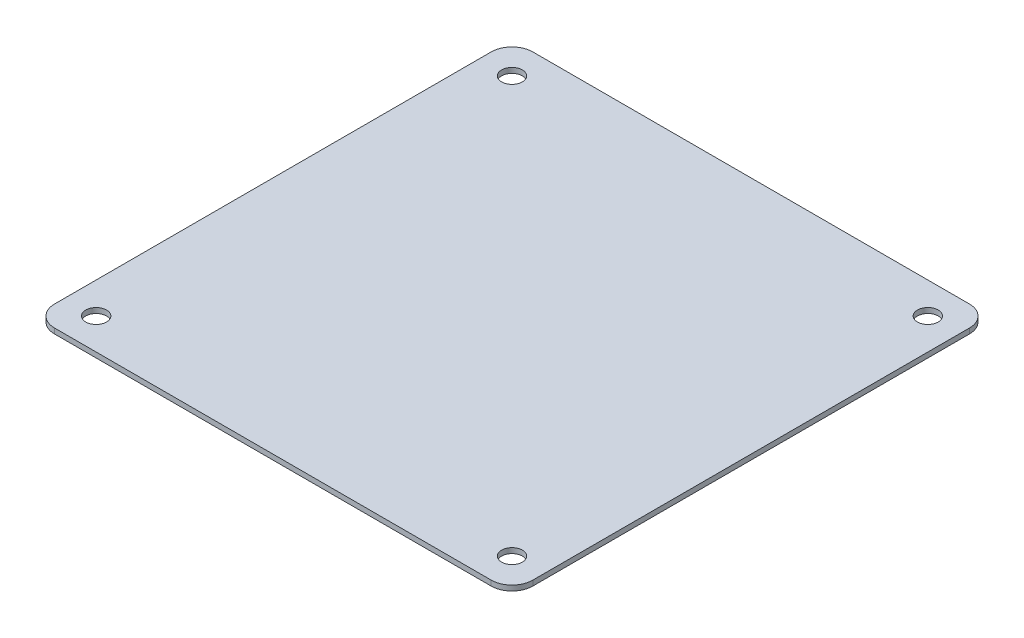
ISO-10303-21;
HEADER;
FILE_DESCRIPTION(('STEP AP214'),'2;1');
FILE_NAME('part.step','',(''),(''),'','','');
FILE_SCHEMA(('AUTOMOTIVE_DESIGN { 1 0 10303 214 1 1 1 1 }'));
ENDSEC;
DATA;
#1=APPLICATION_CONTEXT('core data for automotive mechanical design processes');
#2=APPLICATION_PROTOCOL_DEFINITION('international standard','automotive_design',2000,#1);
#3=PRODUCT_CONTEXT('',#1,'mechanical');
#4=PRODUCT('Part','Part','',(#3));
#5=PRODUCT_RELATED_PRODUCT_CATEGORY('part','',(#4));
#6=PRODUCT_DEFINITION_FORMATION('','',#4);
#7=PRODUCT_DEFINITION_CONTEXT('part definition',#1,'design');
#8=PRODUCT_DEFINITION('design','',#6,#7);
#9=PRODUCT_DEFINITION_SHAPE('','',#8);
#10=(LENGTH_UNIT() NAMED_UNIT(*) SI_UNIT(.MILLI.,.METRE.));
#11=(NAMED_UNIT(*) PLANE_ANGLE_UNIT() SI_UNIT($,.RADIAN.));
#12=(NAMED_UNIT(*) SI_UNIT($,.STERADIAN.) SOLID_ANGLE_UNIT());
#13=UNCERTAINTY_MEASURE_WITH_UNIT(LENGTH_MEASURE(1.E-05),#10,'distance_accuracy_value','');
#14=(GEOMETRIC_REPRESENTATION_CONTEXT(3) GLOBAL_UNCERTAINTY_ASSIGNED_CONTEXT((#13)) GLOBAL_UNIT_ASSIGNED_CONTEXT((#10,
#11,#12)) REPRESENTATION_CONTEXT('',''));
#15=CARTESIAN_POINT('',(0.,0.,0.));
#16=DIRECTION('',(0.,0.,1.));
#17=DIRECTION('',(1.,0.,0.));
#18=AXIS2_PLACEMENT_3D('',#15,#16,#17);
#19=CARTESIAN_POINT('',(21.,0.5,-21.));
#20=DIRECTION('',(0.,1.,0.));
#21=DIRECTION('',(0.,0.,1.));
#22=AXIS2_PLACEMENT_3D('',#19,#20,#21);
#23=PLANE('',#22);
#24=CARTESIAN_POINT('',(-20.,0.5,20.));
#25=DIRECTION('',(0.,1.,0.));
#26=DIRECTION('',(0.,0.,1.));
#27=AXIS2_PLACEMENT_3D('',#24,#25,#26);
#28=CIRCLE('',#27,1.);
#29=CARTESIAN_POINT('',(-20.,0.5,21.));
#30=VERTEX_POINT('',#29);
#31=EDGE_CURVE('E190',#30,#30,#28,.T.);
#32=ORIENTED_EDGE('',*,*,#31,.F.);
#33=EDGE_LOOP('',(#32));
#34=FACE_BOUND('',#33,.T.);
#35=CARTESIAN_POINT('',(-20.,0.5,-20.));
#36=DIRECTION('',(0.,1.,0.));
#37=DIRECTION('',(0.,0.,1.));
#38=AXIS2_PLACEMENT_3D('',#35,#36,#37);
#39=CIRCLE('',#38,1.);
#40=CARTESIAN_POINT('',(-20.,0.5,-19.));
#41=VERTEX_POINT('',#40);
#42=EDGE_CURVE('E136',#41,#41,#39,.T.);
#43=ORIENTED_EDGE('',*,*,#42,.F.);
#44=EDGE_LOOP('',(#43));
#45=FACE_BOUND('',#44,.T.);
#46=CARTESIAN_POINT('',(21.,0.5,-21.));
#47=DIRECTION('',(0.,1.,0.));
#48=DIRECTION('',(0.,0.,1.));
#49=AXIS2_PLACEMENT_3D('',#46,#47,#48);
#50=CIRCLE('',#49,2.);
#51=CARTESIAN_POINT('',(23.,0.5,-21.));
#52=VERTEX_POINT('',#51);
#53=CARTESIAN_POINT('',(21.,0.5,-23.));
#54=VERTEX_POINT('',#53);
#55=EDGE_CURVE('E147',#52,#54,#50,.T.);
#56=ORIENTED_EDGE('',*,*,#55,.T.);
#57=DIRECTION('',(-1.,0.,0.));
#58=VECTOR('',#57,1.);
#59=CARTESIAN_POINT('',(-21.,0.5,-23.));
#60=LINE('',#59,#58);
#61=CARTESIAN_POINT('',(-21.,0.5,-23.));
#62=VERTEX_POINT('',#61);
#63=EDGE_CURVE('E95',#54,#62,#60,.T.);
#64=ORIENTED_EDGE('',*,*,#63,.T.);
#65=CARTESIAN_POINT('',(-21.,0.5,-21.));
#66=DIRECTION('',(0.,1.,0.));
#67=DIRECTION('',(0.,0.,-1.));
#68=AXIS2_PLACEMENT_3D('',#65,#66,#67);
#69=CIRCLE('',#68,2.);
#70=CARTESIAN_POINT('',(-23.,0.5,-21.));
#71=VERTEX_POINT('',#70);
#72=EDGE_CURVE('E162',#62,#71,#69,.T.);
#73=ORIENTED_EDGE('',*,*,#72,.T.);
#74=DIRECTION('',(0.,0.,1.));
#75=VECTOR('',#74,1.);
#76=CARTESIAN_POINT('',(-23.,0.5,-21.));
#77=LINE('',#76,#75);
#78=CARTESIAN_POINT('',(-23.,0.5,21.));
#79=VERTEX_POINT('',#78);
#80=EDGE_CURVE('E175',#71,#79,#77,.T.);
#81=ORIENTED_EDGE('',*,*,#80,.T.);
#82=CARTESIAN_POINT('',(-21.,0.5,21.));
#83=DIRECTION('',(0.,1.,0.));
#84=DIRECTION('',(0.,0.,-1.));
#85=AXIS2_PLACEMENT_3D('',#82,#83,#84);
#86=CIRCLE('',#85,2.);
#87=CARTESIAN_POINT('',(-21.,0.5,23.));
#88=VERTEX_POINT('',#87);
#89=EDGE_CURVE('E114',#79,#88,#86,.T.);
#90=ORIENTED_EDGE('',*,*,#89,.T.);
#91=DIRECTION('',(1.,0.,0.));
#92=VECTOR('',#91,1.);
#93=CARTESIAN_POINT('',(-21.,0.5,23.));
#94=LINE('',#93,#92);
#95=CARTESIAN_POINT('',(21.,0.5,23.));
#96=VERTEX_POINT('',#95);
#97=EDGE_CURVE('E108',#88,#96,#94,.T.);
#98=ORIENTED_EDGE('',*,*,#97,.T.);
#99=CARTESIAN_POINT('',(21.,0.5,21.));
#100=DIRECTION('',(0.,1.,0.));
#101=DIRECTION('',(0.,0.,-1.));
#102=AXIS2_PLACEMENT_3D('',#99,#100,#101);
#103=CIRCLE('',#102,2.);
#104=CARTESIAN_POINT('',(23.,0.5,21.));
#105=VERTEX_POINT('',#104);
#106=EDGE_CURVE('E112',#96,#105,#103,.T.);
#107=ORIENTED_EDGE('',*,*,#106,.T.);
#108=DIRECTION('',(0.,0.,-1.));
#109=VECTOR('',#108,1.);
#110=CARTESIAN_POINT('',(23.,0.5,-21.));
#111=LINE('',#110,#109);
#112=EDGE_CURVE('E52',#105,#52,#111,.T.);
#113=ORIENTED_EDGE('',*,*,#112,.T.);
#114=EDGE_LOOP('',(#56,#64,#73,#81,#90,#98,#107,#113));
#115=FACE_BOUND('',#114,.T.);
#116=CARTESIAN_POINT('',(20.,0.5,-20.));
#117=DIRECTION('',(0.,1.,0.));
#118=DIRECTION('',(0.,0.,1.));
#119=AXIS2_PLACEMENT_3D('',#116,#117,#118);
#120=CIRCLE('',#119,1.);
#121=CARTESIAN_POINT('',(20.,0.5,-19.));
#122=VERTEX_POINT('',#121);
#123=EDGE_CURVE('E184',#122,#122,#120,.T.);
#124=ORIENTED_EDGE('',*,*,#123,.F.);
#125=EDGE_LOOP('',(#124));
#126=FACE_BOUND('',#125,.T.);
#127=CARTESIAN_POINT('',(20.,0.5,20.));
#128=DIRECTION('',(0.,1.,0.));
#129=DIRECTION('',(0.,0.,1.));
#130=AXIS2_PLACEMENT_3D('',#127,#128,#129);
#131=CIRCLE('',#130,0.999999999999998);
#132=CARTESIAN_POINT('',(20.,0.5,21.));
#133=VERTEX_POINT('',#132);
#134=EDGE_CURVE('E196',#133,#133,#131,.T.);
#135=ORIENTED_EDGE('',*,*,#134,.F.);
#136=EDGE_LOOP('',(#135));
#137=FACE_BOUND('',#136,.T.);
#138=ADVANCED_FACE('F35',(#34,#45,#115,#126,#137),#23,.T.);
#139=CARTESIAN_POINT('',(21.,0.,-21.));
#140=DIRECTION('',(0.,1.,0.));
#141=DIRECTION('',(0.,0.,1.));
#142=AXIS2_PLACEMENT_3D('',#139,#140,#141);
#143=PLANE('',#142);
#144=CARTESIAN_POINT('',(21.,0.,-21.));
#145=DIRECTION('',(0.,1.,0.));
#146=DIRECTION('',(0.,0.,1.));
#147=AXIS2_PLACEMENT_3D('',#144,#145,#146);
#148=CIRCLE('',#147,2.);
#149=CARTESIAN_POINT('',(23.,0.,-21.));
#150=VERTEX_POINT('',#149);
#151=CARTESIAN_POINT('',(21.,0.,-23.));
#152=VERTEX_POINT('',#151);
#153=EDGE_CURVE('E132',#150,#152,#148,.T.);
#154=ORIENTED_EDGE('',*,*,#153,.F.);
#155=DIRECTION('',(0.,0.,-1.));
#156=VECTOR('',#155,1.);
#157=CARTESIAN_POINT('',(23.,0.,-21.));
#158=LINE('',#157,#156);
#159=CARTESIAN_POINT('',(23.,0.,21.));
#160=VERTEX_POINT('',#159);
#161=EDGE_CURVE('E87',#160,#150,#158,.T.);
#162=ORIENTED_EDGE('',*,*,#161,.F.);
#163=CARTESIAN_POINT('',(21.,0.,21.));
#164=DIRECTION('',(0.,1.,0.));
#165=DIRECTION('',(0.,0.,-1.));
#166=AXIS2_PLACEMENT_3D('',#163,#164,#165);
#167=CIRCLE('',#166,2.);
#168=CARTESIAN_POINT('',(21.,0.,23.));
#169=VERTEX_POINT('',#168);
#170=EDGE_CURVE('E81',#169,#160,#167,.T.);
#171=ORIENTED_EDGE('',*,*,#170,.F.);
#172=DIRECTION('',(1.,0.,0.));
#173=VECTOR('',#172,1.);
#174=CARTESIAN_POINT('',(-21.,0.,23.));
#175=LINE('',#174,#173);
#176=CARTESIAN_POINT('',(-21.,0.,23.));
#177=VERTEX_POINT('',#176);
#178=EDGE_CURVE('E122',#177,#169,#175,.T.);
#179=ORIENTED_EDGE('',*,*,#178,.F.);
#180=CARTESIAN_POINT('',(-21.,0.,21.));
#181=DIRECTION('',(0.,1.,0.));
#182=DIRECTION('',(0.,0.,-1.));
#183=AXIS2_PLACEMENT_3D('',#180,#181,#182);
#184=CIRCLE('',#183,2.);
#185=CARTESIAN_POINT('',(-23.,0.,21.));
#186=VERTEX_POINT('',#185);
#187=EDGE_CURVE('E142',#186,#177,#184,.T.);
#188=ORIENTED_EDGE('',*,*,#187,.F.);
#189=DIRECTION('',(0.,0.,1.));
#190=VECTOR('',#189,1.);
#191=CARTESIAN_POINT('',(-23.,0.,-21.));
#192=LINE('',#191,#190);
#193=CARTESIAN_POINT('',(-23.,0.,-21.));
#194=VERTEX_POINT('',#193);
#195=EDGE_CURVE('E140',#194,#186,#192,.T.);
#196=ORIENTED_EDGE('',*,*,#195,.F.);
#197=CARTESIAN_POINT('',(-21.,0.,-21.));
#198=DIRECTION('',(0.,1.,0.));
#199=DIRECTION('',(0.,0.,-1.));
#200=AXIS2_PLACEMENT_3D('',#197,#198,#199);
#201=CIRCLE('',#200,2.);
#202=CARTESIAN_POINT('',(-21.,0.,-23.));
#203=VERTEX_POINT('',#202);
#204=EDGE_CURVE('E138',#203,#194,#201,.T.);
#205=ORIENTED_EDGE('',*,*,#204,.F.);
#206=DIRECTION('',(-1.,0.,0.));
#207=VECTOR('',#206,1.);
#208=CARTESIAN_POINT('',(-21.,0.,-23.));
#209=LINE('',#208,#207);
#210=EDGE_CURVE('E135',#152,#203,#209,.T.);
#211=ORIENTED_EDGE('',*,*,#210,.F.);
#212=EDGE_LOOP('',(#154,#162,#171,#179,#188,#196,#205,#211));
#213=FACE_BOUND('',#212,.T.);
#214=CARTESIAN_POINT('',(-20.,0.,-20.));
#215=DIRECTION('',(0.,1.,0.));
#216=DIRECTION('',(0.,0.,1.));
#217=AXIS2_PLACEMENT_3D('',#214,#215,#216);
#218=CIRCLE('',#217,1.);
#219=CARTESIAN_POINT('',(-20.,0.,-19.));
#220=VERTEX_POINT('',#219);
#221=EDGE_CURVE('E181',#220,#220,#218,.T.);
#222=ORIENTED_EDGE('',*,*,#221,.T.);
#223=EDGE_LOOP('',(#222));
#224=FACE_BOUND('',#223,.T.);
#225=CARTESIAN_POINT('',(20.,0.,-20.));
#226=DIRECTION('',(0.,1.,0.));
#227=DIRECTION('',(0.,0.,1.));
#228=AXIS2_PLACEMENT_3D('',#225,#226,#227);
#229=CIRCLE('',#228,1.);
#230=CARTESIAN_POINT('',(20.,0.,-19.));
#231=VERTEX_POINT('',#230);
#232=EDGE_CURVE('E187',#231,#231,#229,.T.);
#233=ORIENTED_EDGE('',*,*,#232,.T.);
#234=EDGE_LOOP('',(#233));
#235=FACE_BOUND('',#234,.T.);
#236=CARTESIAN_POINT('',(-20.,0.,20.));
#237=DIRECTION('',(0.,1.,0.));
#238=DIRECTION('',(0.,0.,1.));
#239=AXIS2_PLACEMENT_3D('',#236,#237,#238);
#240=CIRCLE('',#239,1.);
#241=CARTESIAN_POINT('',(-20.,0.,21.));
#242=VERTEX_POINT('',#241);
#243=EDGE_CURVE('E193',#242,#242,#240,.T.);
#244=ORIENTED_EDGE('',*,*,#243,.T.);
#245=EDGE_LOOP('',(#244));
#246=FACE_BOUND('',#245,.T.);
#247=CARTESIAN_POINT('',(20.,0.,20.));
#248=DIRECTION('',(0.,1.,0.));
#249=DIRECTION('',(0.,0.,1.));
#250=AXIS2_PLACEMENT_3D('',#247,#248,#249);
#251=CIRCLE('',#250,0.999999999999998);
#252=CARTESIAN_POINT('',(20.,0.,21.));
#253=VERTEX_POINT('',#252);
#254=EDGE_CURVE('E199',#253,#253,#251,.T.);
#255=ORIENTED_EDGE('',*,*,#254,.T.);
#256=EDGE_LOOP('',(#255));
#257=FACE_BOUND('',#256,.T.);
#258=ADVANCED_FACE('F166',(#213,#224,#235,#246,#257),#143,.F.);
#259=CARTESIAN_POINT('',(21.,0.5,-21.));
#260=DIRECTION('',(0.,-1.,0.));
#261=DIRECTION('',(0.,0.,-1.));
#262=AXIS2_PLACEMENT_3D('',#259,#260,#261);
#263=CYLINDRICAL_SURFACE('',#262,2.);
#264=ORIENTED_EDGE('',*,*,#153,.T.);
#265=DIRECTION('',(0.,-1.,0.));
#266=VECTOR('',#265,1.);
#267=CARTESIAN_POINT('',(21.,0.5,-23.));
#268=LINE('',#267,#266);
#269=EDGE_CURVE('E11',#54,#152,#268,.T.);
#270=ORIENTED_EDGE('',*,*,#269,.F.);
#271=ORIENTED_EDGE('',*,*,#55,.F.);
#272=DIRECTION('',(0.,-1.,0.));
#273=VECTOR('',#272,1.);
#274=CARTESIAN_POINT('',(23.,0.5,-21.));
#275=LINE('',#274,#273);
#276=EDGE_CURVE('E128',#52,#150,#275,.T.);
#277=ORIENTED_EDGE('',*,*,#276,.T.);
#278=EDGE_LOOP('',(#264,#270,#271,#277));
#279=FACE_BOUND('',#278,.T.);
#280=ADVANCED_FACE('F37',(#279),#263,.T.);
#281=CARTESIAN_POINT('',(-21.,0.5,-23.));
#282=DIRECTION('',(0.,0.,1.));
#283=DIRECTION('',(1.,0.,0.));
#284=AXIS2_PLACEMENT_3D('',#281,#282,#283);
#285=PLANE('',#284);
#286=ORIENTED_EDGE('',*,*,#210,.T.);
#287=DIRECTION('',(0.,-1.,0.));
#288=VECTOR('',#287,1.);
#289=CARTESIAN_POINT('',(-21.,0.5,-23.));
#290=LINE('',#289,#288);
#291=EDGE_CURVE('E44',#62,#203,#290,.T.);
#292=ORIENTED_EDGE('',*,*,#291,.F.);
#293=ORIENTED_EDGE('',*,*,#63,.F.);
#294=ORIENTED_EDGE('',*,*,#269,.T.);
#295=EDGE_LOOP('',(#286,#292,#293,#294));
#296=FACE_BOUND('',#295,.T.);
#297=ADVANCED_FACE('F233',(#296),#285,.F.);
#298=CARTESIAN_POINT('',(-21.,0.5,-21.));
#299=DIRECTION('',(0.,-1.,0.));
#300=DIRECTION('',(0.,0.,-1.));
#301=AXIS2_PLACEMENT_3D('',#298,#299,#300);
#302=CYLINDRICAL_SURFACE('',#301,2.);
#303=ORIENTED_EDGE('',*,*,#204,.T.);
#304=DIRECTION('',(0.,-1.,0.));
#305=VECTOR('',#304,1.);
#306=CARTESIAN_POINT('',(-23.,0.5,-21.));
#307=LINE('',#306,#305);
#308=EDGE_CURVE('E154',#71,#194,#307,.T.);
#309=ORIENTED_EDGE('',*,*,#308,.F.);
#310=ORIENTED_EDGE('',*,*,#72,.F.);
#311=ORIENTED_EDGE('',*,*,#291,.T.);
#312=EDGE_LOOP('',(#303,#309,#310,#311));
#313=FACE_BOUND('',#312,.T.);
#314=ADVANCED_FACE('F160',(#313),#302,.T.);
#315=CARTESIAN_POINT('',(-23.,0.5,-21.));
#316=DIRECTION('',(1.,0.,0.));
#317=DIRECTION('',(0.,0.,-1.));
#318=AXIS2_PLACEMENT_3D('',#315,#316,#317);
#319=PLANE('',#318);
#320=ORIENTED_EDGE('',*,*,#195,.T.);
#321=DIRECTION('',(0.,-1.,0.));
#322=VECTOR('',#321,1.);
#323=CARTESIAN_POINT('',(-23.,0.5,21.));
#324=LINE('',#323,#322);
#325=EDGE_CURVE('E151',#79,#186,#324,.T.);
#326=ORIENTED_EDGE('',*,*,#325,.F.);
#327=ORIENTED_EDGE('',*,*,#80,.F.);
#328=ORIENTED_EDGE('',*,*,#308,.T.);
#329=EDGE_LOOP('',(#320,#326,#327,#328));
#330=FACE_BOUND('',#329,.T.);
#331=ADVANCED_FACE('F171',(#330),#319,.F.);
#332=CARTESIAN_POINT('',(-21.,0.5,21.));
#333=DIRECTION('',(0.,-1.,0.));
#334=DIRECTION('',(0.,0.,-1.));
#335=AXIS2_PLACEMENT_3D('',#332,#333,#334);
#336=CYLINDRICAL_SURFACE('',#335,2.);
#337=ORIENTED_EDGE('',*,*,#187,.T.);
#338=DIRECTION('',(0.,-1.,0.));
#339=VECTOR('',#338,1.);
#340=CARTESIAN_POINT('',(-21.,0.5,23.));
#341=LINE('',#340,#339);
#342=EDGE_CURVE('E123',#88,#177,#341,.T.);
#343=ORIENTED_EDGE('',*,*,#342,.F.);
#344=ORIENTED_EDGE('',*,*,#89,.F.);
#345=ORIENTED_EDGE('',*,*,#325,.T.);
#346=EDGE_LOOP('',(#337,#343,#344,#345));
#347=FACE_BOUND('',#346,.T.);
#348=ADVANCED_FACE('F174',(#347),#336,.T.);
#349=CARTESIAN_POINT('',(-21.,0.5,23.));
#350=DIRECTION('',(0.,0.,-1.));
#351=DIRECTION('',(-1.,0.,0.));
#352=AXIS2_PLACEMENT_3D('',#349,#350,#351);
#353=PLANE('',#352);
#354=ORIENTED_EDGE('',*,*,#178,.T.);
#355=DIRECTION('',(0.,-1.,0.));
#356=VECTOR('',#355,1.);
#357=CARTESIAN_POINT('',(21.,0.5,23.));
#358=LINE('',#357,#356);
#359=EDGE_CURVE('E119',#96,#169,#358,.T.);
#360=ORIENTED_EDGE('',*,*,#359,.F.);
#361=ORIENTED_EDGE('',*,*,#97,.F.);
#362=ORIENTED_EDGE('',*,*,#342,.T.);
#363=EDGE_LOOP('',(#354,#360,#361,#362));
#364=FACE_BOUND('',#363,.T.);
#365=ADVANCED_FACE('F120',(#364),#353,.F.);
#366=CARTESIAN_POINT('',(21.,0.5,21.));
#367=DIRECTION('',(0.,-1.,0.));
#368=DIRECTION('',(0.,0.,-1.));
#369=AXIS2_PLACEMENT_3D('',#366,#367,#368);
#370=CYLINDRICAL_SURFACE('',#369,2.);
#371=ORIENTED_EDGE('',*,*,#170,.T.);
#372=DIRECTION('',(0.,-1.,0.));
#373=VECTOR('',#372,1.);
#374=CARTESIAN_POINT('',(23.,0.5,21.));
#375=LINE('',#374,#373);
#376=EDGE_CURVE('E124',#105,#160,#375,.T.);
#377=ORIENTED_EDGE('',*,*,#376,.F.);
#378=ORIENTED_EDGE('',*,*,#106,.F.);
#379=ORIENTED_EDGE('',*,*,#359,.T.);
#380=EDGE_LOOP('',(#371,#377,#378,#379));
#381=FACE_BOUND('',#380,.T.);
#382=ADVANCED_FACE('F126',(#381),#370,.T.);
#383=CARTESIAN_POINT('',(23.,0.5,-21.));
#384=DIRECTION('',(-1.,0.,0.));
#385=DIRECTION('',(0.,0.,1.));
#386=AXIS2_PLACEMENT_3D('',#383,#384,#385);
#387=PLANE('',#386);
#388=ORIENTED_EDGE('',*,*,#161,.T.);
#389=ORIENTED_EDGE('',*,*,#276,.F.);
#390=ORIENTED_EDGE('',*,*,#112,.F.);
#391=ORIENTED_EDGE('',*,*,#376,.T.);
#392=EDGE_LOOP('',(#388,#389,#390,#391));
#393=FACE_BOUND('',#392,.T.);
#394=ADVANCED_FACE('F221',(#393),#387,.F.);
#395=CARTESIAN_POINT('',(-20.,0.5,-20.));
#396=DIRECTION('',(0.,-1.,0.));
#397=DIRECTION('',(0.,0.,-1.));
#398=AXIS2_PLACEMENT_3D('',#395,#396,#397);
#399=CYLINDRICAL_SURFACE('',#398,1.);
#400=ORIENTED_EDGE('',*,*,#42,.T.);
#401=EDGE_LOOP('',(#400));
#402=FACE_BOUND('',#401,.T.);
#403=ORIENTED_EDGE('',*,*,#221,.F.);
#404=EDGE_LOOP('',(#403));
#405=FACE_BOUND('',#404,.T.);
#406=ADVANCED_FACE('F218',(#402,#405),#399,.F.);
#407=CARTESIAN_POINT('',(20.,0.5,-20.));
#408=DIRECTION('',(0.,-1.,0.));
#409=DIRECTION('',(0.,0.,-1.));
#410=AXIS2_PLACEMENT_3D('',#407,#408,#409);
#411=CYLINDRICAL_SURFACE('',#410,1.);
#412=ORIENTED_EDGE('',*,*,#123,.T.);
#413=EDGE_LOOP('',(#412));
#414=FACE_BOUND('',#413,.T.);
#415=ORIENTED_EDGE('',*,*,#232,.F.);
#416=EDGE_LOOP('',(#415));
#417=FACE_BOUND('',#416,.T.);
#418=ADVANCED_FACE('F297',(#414,#417),#411,.F.);
#419=CARTESIAN_POINT('',(-20.,0.5,20.));
#420=DIRECTION('',(0.,-1.,0.));
#421=DIRECTION('',(0.,0.,-1.));
#422=AXIS2_PLACEMENT_3D('',#419,#420,#421);
#423=CYLINDRICAL_SURFACE('',#422,1.);
#424=ORIENTED_EDGE('',*,*,#31,.T.);
#425=EDGE_LOOP('',(#424));
#426=FACE_BOUND('',#425,.T.);
#427=ORIENTED_EDGE('',*,*,#243,.F.);
#428=EDGE_LOOP('',(#427));
#429=FACE_BOUND('',#428,.T.);
#430=ADVANCED_FACE('F305',(#426,#429),#423,.F.);
#431=CARTESIAN_POINT('',(20.,0.5,20.));
#432=DIRECTION('',(0.,-1.,0.));
#433=DIRECTION('',(0.,0.,-1.));
#434=AXIS2_PLACEMENT_3D('',#431,#432,#433);
#435=CYLINDRICAL_SURFACE('',#434,0.999999999999998);
#436=ORIENTED_EDGE('',*,*,#134,.T.);
#437=EDGE_LOOP('',(#436));
#438=FACE_BOUND('',#437,.T.);
#439=ORIENTED_EDGE('',*,*,#254,.F.);
#440=EDGE_LOOP('',(#439));
#441=FACE_BOUND('',#440,.T.);
#442=ADVANCED_FACE('F205',(#438,#441),#435,.F.);
#443=CLOSED_SHELL('',(#138,#258,#280,#297,#314,#331,#348,#365,#382,#394,#406,#418,#430,#442));
#444=MANIFOLD_SOLID_BREP('B2',#443);
#445=ADVANCED_BREP_SHAPE_REPRESENTATION('',(#18,#444),#14);
#446=SHAPE_DEFINITION_REPRESENTATION(#9,#445);
ENDSEC;
END-ISO-10303-21;
